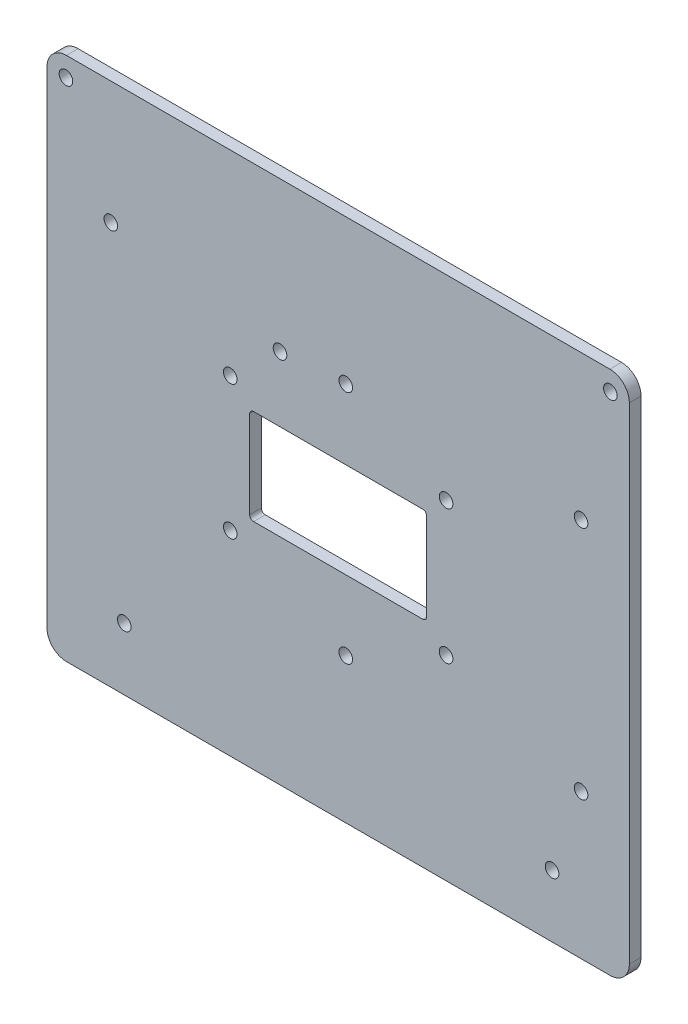
ISO-10303-21;
HEADER;
FILE_DESCRIPTION(('STEP AP214'),'2;1');
FILE_NAME('part.step','',(''),(''),'','','');
FILE_SCHEMA(('AUTOMOTIVE_DESIGN { 1 0 10303 214 1 1 1 1 }'));
ENDSEC;
DATA;
#1=APPLICATION_CONTEXT('core data for automotive mechanical design processes');
#2=APPLICATION_PROTOCOL_DEFINITION('international standard','automotive_design',2000,#1);
#3=PRODUCT_CONTEXT('',#1,'mechanical');
#4=PRODUCT('Part','Part','',(#3));
#5=PRODUCT_RELATED_PRODUCT_CATEGORY('part','',(#4));
#6=PRODUCT_DEFINITION_FORMATION('','',#4);
#7=PRODUCT_DEFINITION_CONTEXT('part definition',#1,'design');
#8=PRODUCT_DEFINITION('design','',#6,#7);
#9=PRODUCT_DEFINITION_SHAPE('','',#8);
#10=(LENGTH_UNIT() NAMED_UNIT(*) SI_UNIT(.MILLI.,.METRE.));
#11=(NAMED_UNIT(*) PLANE_ANGLE_UNIT() SI_UNIT($,.RADIAN.));
#12=(NAMED_UNIT(*) SI_UNIT($,.STERADIAN.) SOLID_ANGLE_UNIT());
#13=UNCERTAINTY_MEASURE_WITH_UNIT(LENGTH_MEASURE(1.E-05),#10,'distance_accuracy_value','');
#14=(GEOMETRIC_REPRESENTATION_CONTEXT(3) GLOBAL_UNCERTAINTY_ASSIGNED_CONTEXT((#13)) GLOBAL_UNIT_ASSIGNED_CONTEXT((#10,
#11,#12)) REPRESENTATION_CONTEXT('',''));
#15=CARTESIAN_POINT('',(0.,0.,0.));
#16=DIRECTION('',(0.,0.,1.));
#17=DIRECTION('',(1.,0.,0.));
#18=AXIS2_PLACEMENT_3D('',#15,#16,#17);
#19=CARTESIAN_POINT('',(0.,0.,3.));
#20=DIRECTION('',(0.,0.,1.));
#21=DIRECTION('',(1.,0.,0.));
#22=AXIS2_PLACEMENT_3D('',#19,#20,#21);
#23=PLANE('',#22);
#24=CARTESIAN_POINT('',(27.75,-17.25,3.));
#25=DIRECTION('',(0.,0.,1.));
#26=DIRECTION('',(1.,0.,0.));
#27=AXIS2_PLACEMENT_3D('',#24,#25,#26);
#28=CIRCLE('',#27,1.75);
#29=CARTESIAN_POINT('',(29.5,-17.25,3.));
#30=VERTEX_POINT('',#29);
#31=EDGE_CURVE('E841',#30,#30,#28,.T.);
#32=ORIENTED_EDGE('',*,*,#31,.F.);
#33=EDGE_LOOP('',(#32));
#34=FACE_BOUND('',#33,.T.);
#35=CARTESIAN_POINT('',(-27.75,17.25,3.));
#36=DIRECTION('',(0.,0.,1.));
#37=DIRECTION('',(1.,0.,0.));
#38=AXIS2_PLACEMENT_3D('',#35,#36,#37);
#39=CIRCLE('',#38,1.75);
#40=CARTESIAN_POINT('',(-26.,17.25,3.));
#41=VERTEX_POINT('',#40);
#42=EDGE_CURVE('E825',#41,#41,#39,.T.);
#43=ORIENTED_EDGE('',*,*,#42,.F.);
#44=EDGE_LOOP('',(#43));
#45=FACE_BOUND('',#44,.T.);
#46=CARTESIAN_POINT('',(62.4583333333333,-30.25,3.));
#47=DIRECTION('',(0.,0.,1.));
#48=DIRECTION('',(1.,0.,0.));
#49=AXIS2_PLACEMENT_3D('',#46,#47,#48);
#50=CIRCLE('',#49,1.74999999999996);
#51=CARTESIAN_POINT('',(64.2083333333333,-30.25,3.));
#52=VERTEX_POINT('',#51);
#53=EDGE_CURVE('E809',#52,#52,#50,.T.);
#54=ORIENTED_EDGE('',*,*,#53,.F.);
#55=EDGE_LOOP('',(#54));
#56=FACE_BOUND('',#55,.T.);
#57=CARTESIAN_POINT('',(1.95833333333333,30.25,3.));
#58=DIRECTION('',(0.,0.,1.));
#59=DIRECTION('',(1.,0.,0.));
#60=AXIS2_PLACEMENT_3D('',#57,#58,#59);
#61=CIRCLE('',#60,1.75);
#62=CARTESIAN_POINT('',(3.70833333333333,30.25,3.));
#63=VERTEX_POINT('',#62);
#64=EDGE_CURVE('E793',#63,#63,#61,.T.);
#65=ORIENTED_EDGE('',*,*,#64,.F.);
#66=EDGE_LOOP('',(#65));
#67=FACE_BOUND('',#66,.T.);
#68=CARTESIAN_POINT('',(-58.4583333333333,36.,3.));
#69=DIRECTION('',(0.,0.,1.));
#70=DIRECTION('',(1.,0.,0.));
#71=AXIS2_PLACEMENT_3D('',#68,#69,#70);
#72=CIRCLE('',#71,1.75);
#73=CARTESIAN_POINT('',(-56.7083333333333,36.,3.));
#74=VERTEX_POINT('',#73);
#75=EDGE_CURVE('E778',#74,#74,#72,.T.);
#76=ORIENTED_EDGE('',*,*,#75,.F.);
#77=EDGE_LOOP('',(#76));
#78=FACE_BOUND('',#77,.T.);
#79=CARTESIAN_POINT('',(70.,62.5,3.));
#80=DIRECTION('',(0.,0.,1.));
#81=DIRECTION('',(1.,0.,0.));
#82=AXIS2_PLACEMENT_3D('',#79,#80,#81);
#83=CIRCLE('',#82,1.75);
#84=CARTESIAN_POINT('',(71.75,62.5,3.));
#85=VERTEX_POINT('',#84);
#86=EDGE_CURVE('E327',#85,#85,#83,.T.);
#87=ORIENTED_EDGE('',*,*,#86,.F.);
#88=EDGE_LOOP('',(#87));
#89=FACE_BOUND('',#88,.T.);
#90=CARTESIAN_POINT('',(55.,-51.5,3.));
#91=DIRECTION('',(0.,0.,1.));
#92=DIRECTION('',(1.,0.,0.));
#93=AXIS2_PLACEMENT_3D('',#90,#91,#92);
#94=CIRCLE('',#93,1.75);
#95=CARTESIAN_POINT('',(56.75,-51.5,3.));
#96=VERTEX_POINT('',#95);
#97=EDGE_CURVE('E340',#96,#96,#94,.T.);
#98=ORIENTED_EDGE('',*,*,#97,.F.);
#99=EDGE_LOOP('',(#98));
#100=FACE_BOUND('',#99,.T.);
#101=DIRECTION('',(1.,0.,0.));
#102=VECTOR('',#101,1.);
#103=CARTESIAN_POINT('',(-74.875,-67.5,3.));
#104=LINE('',#103,#102);
#105=CARTESIAN_POINT('',(-69.875,-67.5,3.));
#106=VERTEX_POINT('',#105);
#107=CARTESIAN_POINT('',(69.875,-67.5,3.));
#108=VERTEX_POINT('',#107);
#109=EDGE_CURVE('E350',#106,#108,#104,.T.);
#110=ORIENTED_EDGE('',*,*,#109,.T.);
#111=CARTESIAN_POINT('',(69.875,-62.5,3.));
#112=DIRECTION('',(0.,0.,1.));
#113=DIRECTION('',(1.,0.,0.));
#114=AXIS2_PLACEMENT_3D('',#111,#112,#113);
#115=CIRCLE('',#114,5.);
#116=CARTESIAN_POINT('',(74.875,-62.5,3.));
#117=VERTEX_POINT('',#116);
#118=EDGE_CURVE('E223',#108,#117,#115,.T.);
#119=ORIENTED_EDGE('',*,*,#118,.T.);
#120=DIRECTION('',(0.,1.,0.));
#121=VECTOR('',#120,1.);
#122=CARTESIAN_POINT('',(74.875,67.5,3.));
#123=LINE('',#122,#121);
#124=CARTESIAN_POINT('',(74.875,62.5,3.));
#125=VERTEX_POINT('',#124);
#126=EDGE_CURVE('E178',#117,#125,#123,.T.);
#127=ORIENTED_EDGE('',*,*,#126,.T.);
#128=CARTESIAN_POINT('',(69.875,62.5,3.));
#129=DIRECTION('',(0.,0.,1.));
#130=DIRECTION('',(1.,0.,0.));
#131=AXIS2_PLACEMENT_3D('',#128,#129,#130);
#132=CIRCLE('',#131,5.);
#133=CARTESIAN_POINT('',(69.875,67.5,3.));
#134=VERTEX_POINT('',#133);
#135=EDGE_CURVE('E214',#125,#134,#132,.T.);
#136=ORIENTED_EDGE('',*,*,#135,.T.);
#137=DIRECTION('',(-1.,0.,0.));
#138=VECTOR('',#137,1.);
#139=CARTESIAN_POINT('',(-74.875,67.5,3.));
#140=LINE('',#139,#138);
#141=CARTESIAN_POINT('',(-69.875,67.5,3.));
#142=VERTEX_POINT('',#141);
#143=EDGE_CURVE('E200',#134,#142,#140,.T.);
#144=ORIENTED_EDGE('',*,*,#143,.T.);
#145=CARTESIAN_POINT('',(-69.875,62.5,3.));
#146=DIRECTION('',(0.,0.,1.));
#147=DIRECTION('',(1.,0.,0.));
#148=AXIS2_PLACEMENT_3D('',#145,#146,#147);
#149=CIRCLE('',#148,5.);
#150=CARTESIAN_POINT('',(-74.875,62.5,3.));
#151=VERTEX_POINT('',#150);
#152=EDGE_CURVE('E217',#142,#151,#149,.T.);
#153=ORIENTED_EDGE('',*,*,#152,.T.);
#154=DIRECTION('',(0.,-1.,0.));
#155=VECTOR('',#154,1.);
#156=CARTESIAN_POINT('',(-74.875,67.5,3.));
#157=LINE('',#156,#155);
#158=CARTESIAN_POINT('',(-74.875,-62.5,3.));
#159=VERTEX_POINT('',#158);
#160=EDGE_CURVE('E193',#151,#159,#157,.T.);
#161=ORIENTED_EDGE('',*,*,#160,.T.);
#162=CARTESIAN_POINT('',(-69.875,-62.5,3.));
#163=DIRECTION('',(0.,0.,1.));
#164=DIRECTION('',(1.,0.,0.));
#165=AXIS2_PLACEMENT_3D('',#162,#163,#164);
#166=CIRCLE('',#165,5.);
#167=EDGE_CURVE('E220',#159,#106,#166,.T.);
#168=ORIENTED_EDGE('',*,*,#167,.T.);
#169=EDGE_LOOP('',(#110,#119,#127,#136,#144,#153,#161,#168));
#170=FACE_BOUND('',#169,.T.);
#171=CARTESIAN_POINT('',(-55.,-51.5,3.));
#172=DIRECTION('',(0.,0.,1.));
#173=DIRECTION('',(-1.,0.,0.));
#174=AXIS2_PLACEMENT_3D('',#171,#172,#173);
#175=CIRCLE('',#174,1.75);
#176=CARTESIAN_POINT('',(-56.75,-51.5,3.));
#177=VERTEX_POINT('',#176);
#178=EDGE_CURVE('E332',#177,#177,#175,.T.);
#179=ORIENTED_EDGE('',*,*,#178,.F.);
#180=EDGE_LOOP('',(#179));
#181=FACE_BOUND('',#180,.T.);
#182=DIRECTION('',(1.,0.,0.));
#183=VECTOR('',#182,1.);
#184=CARTESIAN_POINT('',(-22.75,-12.25,3.));
#185=LINE('',#184,#183);
#186=CARTESIAN_POINT('',(-21.75,-12.25,3.));
#187=VERTEX_POINT('',#186);
#188=CARTESIAN_POINT('',(21.75,-12.25,3.));
#189=VERTEX_POINT('',#188);
#190=EDGE_CURVE('E306',#187,#189,#185,.T.);
#191=ORIENTED_EDGE('',*,*,#190,.F.);
#192=CARTESIAN_POINT('',(-21.75,-11.25,3.));
#193=DIRECTION('',(0.,0.,1.));
#194=DIRECTION('',(1.,0.,0.));
#195=AXIS2_PLACEMENT_3D('',#192,#193,#194);
#196=CIRCLE('',#195,1.);
#197=CARTESIAN_POINT('',(-22.75,-11.25,3.));
#198=VERTEX_POINT('',#197);
#199=EDGE_CURVE('E11',#187,#198,#196,.F.);
#200=ORIENTED_EDGE('',*,*,#199,.T.);
#201=DIRECTION('',(0.,-1.,0.));
#202=VECTOR('',#201,1.);
#203=CARTESIAN_POINT('',(-22.75,12.25,3.));
#204=LINE('',#203,#202);
#205=CARTESIAN_POINT('',(-22.75,11.25,3.));
#206=VERTEX_POINT('',#205);
#207=EDGE_CURVE('E303',#206,#198,#204,.T.);
#208=ORIENTED_EDGE('',*,*,#207,.F.);
#209=CARTESIAN_POINT('',(-21.75,11.25,3.));
#210=DIRECTION('',(0.,0.,1.));
#211=DIRECTION('',(1.,0.,0.));
#212=AXIS2_PLACEMENT_3D('',#209,#210,#211);
#213=CIRCLE('',#212,1.);
#214=CARTESIAN_POINT('',(-21.75,12.25,3.));
#215=VERTEX_POINT('',#214);
#216=EDGE_CURVE('E282',#206,#215,#213,.F.);
#217=ORIENTED_EDGE('',*,*,#216,.T.);
#218=DIRECTION('',(-1.,0.,0.));
#219=VECTOR('',#218,1.);
#220=CARTESIAN_POINT('',(-22.75,12.25,3.));
#221=LINE('',#220,#219);
#222=CARTESIAN_POINT('',(21.75,12.25,3.));
#223=VERTEX_POINT('',#222);
#224=EDGE_CURVE('E321',#223,#215,#221,.T.);
#225=ORIENTED_EDGE('',*,*,#224,.F.);
#226=CARTESIAN_POINT('',(21.75,11.25,3.));
#227=DIRECTION('',(0.,0.,1.));
#228=DIRECTION('',(1.,0.,0.));
#229=AXIS2_PLACEMENT_3D('',#226,#227,#228);
#230=CIRCLE('',#229,1.);
#231=CARTESIAN_POINT('',(22.75,11.25,3.));
#232=VERTEX_POINT('',#231);
#233=EDGE_CURVE('E270',#223,#232,#230,.F.);
#234=ORIENTED_EDGE('',*,*,#233,.T.);
#235=DIRECTION('',(0.,1.,0.));
#236=VECTOR('',#235,1.);
#237=CARTESIAN_POINT('',(22.75,12.25,3.));
#238=LINE('',#237,#236);
#239=CARTESIAN_POINT('',(22.75,-11.25,3.));
#240=VERTEX_POINT('',#239);
#241=EDGE_CURVE('E311',#240,#232,#238,.T.);
#242=ORIENTED_EDGE('',*,*,#241,.F.);
#243=CARTESIAN_POINT('',(21.75,-11.25,3.));
#244=DIRECTION('',(0.,0.,1.));
#245=DIRECTION('',(1.,0.,0.));
#246=AXIS2_PLACEMENT_3D('',#243,#244,#245);
#247=CIRCLE('',#246,1.);
#248=EDGE_CURVE('E276',#240,#189,#247,.F.);
#249=ORIENTED_EDGE('',*,*,#248,.T.);
#250=EDGE_LOOP('',(#191,#200,#208,#217,#225,#234,#242,#249));
#251=FACE_BOUND('',#250,.T.);
#252=CARTESIAN_POINT('',(-70.,62.5,3.));
#253=DIRECTION('',(0.,0.,1.));
#254=DIRECTION('',(1.,0.,0.));
#255=AXIS2_PLACEMENT_3D('',#252,#253,#254);
#256=CIRCLE('',#255,1.75);
#257=CARTESIAN_POINT('',(-68.25,62.5,3.));
#258=VERTEX_POINT('',#257);
#259=EDGE_CURVE('E769',#258,#258,#256,.T.);
#260=ORIENTED_EDGE('',*,*,#259,.F.);
#261=EDGE_LOOP('',(#260));
#262=FACE_BOUND('',#261,.T.);
#263=CARTESIAN_POINT('',(-14.9583333333333,29.,3.));
#264=DIRECTION('',(0.,0.,1.));
#265=DIRECTION('',(1.,0.,0.));
#266=AXIS2_PLACEMENT_3D('',#263,#264,#265);
#267=CIRCLE('',#266,1.75);
#268=CARTESIAN_POINT('',(-13.2083333333333,29.,3.));
#269=VERTEX_POINT('',#268);
#270=EDGE_CURVE('E785',#269,#269,#267,.T.);
#271=ORIENTED_EDGE('',*,*,#270,.F.);
#272=EDGE_LOOP('',(#271));
#273=FACE_BOUND('',#272,.T.);
#274=CARTESIAN_POINT('',(62.4583333333333,30.25,3.));
#275=DIRECTION('',(0.,0.,1.));
#276=DIRECTION('',(1.,0.,0.));
#277=AXIS2_PLACEMENT_3D('',#274,#275,#276);
#278=CIRCLE('',#277,1.75);
#279=CARTESIAN_POINT('',(64.2083333333333,30.25,3.));
#280=VERTEX_POINT('',#279);
#281=EDGE_CURVE('E801',#280,#280,#278,.T.);
#282=ORIENTED_EDGE('',*,*,#281,.F.);
#283=EDGE_LOOP('',(#282));
#284=FACE_BOUND('',#283,.T.);
#285=CARTESIAN_POINT('',(1.95833333333333,-30.25,3.));
#286=DIRECTION('',(0.,0.,1.));
#287=DIRECTION('',(1.,0.,0.));
#288=AXIS2_PLACEMENT_3D('',#285,#286,#287);
#289=CIRCLE('',#288,1.75);
#290=CARTESIAN_POINT('',(3.70833333333333,-30.25,3.));
#291=VERTEX_POINT('',#290);
#292=EDGE_CURVE('E817',#291,#291,#289,.T.);
#293=ORIENTED_EDGE('',*,*,#292,.F.);
#294=EDGE_LOOP('',(#293));
#295=FACE_BOUND('',#294,.T.);
#296=CARTESIAN_POINT('',(27.75,17.25,3.));
#297=DIRECTION('',(0.,0.,1.));
#298=DIRECTION('',(1.,0.,0.));
#299=AXIS2_PLACEMENT_3D('',#296,#297,#298);
#300=CIRCLE('',#299,1.75);
#301=CARTESIAN_POINT('',(29.5,17.25,3.));
#302=VERTEX_POINT('',#301);
#303=EDGE_CURVE('E833',#302,#302,#300,.T.);
#304=ORIENTED_EDGE('',*,*,#303,.F.);
#305=EDGE_LOOP('',(#304));
#306=FACE_BOUND('',#305,.T.);
#307=CARTESIAN_POINT('',(-27.75,-17.25,3.));
#308=DIRECTION('',(0.,0.,1.));
#309=DIRECTION('',(1.,0.,0.));
#310=AXIS2_PLACEMENT_3D('',#307,#308,#309);
#311=CIRCLE('',#310,1.75);
#312=CARTESIAN_POINT('',(-26.,-17.25,3.));
#313=VERTEX_POINT('',#312);
#314=EDGE_CURVE('E849',#313,#313,#311,.T.);
#315=ORIENTED_EDGE('',*,*,#314,.F.);
#316=EDGE_LOOP('',(#315));
#317=FACE_BOUND('',#316,.T.);
#318=ADVANCED_FACE('F43',(#34,#45,#56,#67,#78,#89,#100,#170,#181,#251,#262,#273,#284,#295,#306,
#317),#23,.T.);
#319=CARTESIAN_POINT('',(0.,0.,0.));
#320=DIRECTION('',(0.,0.,1.));
#321=DIRECTION('',(1.,0.,0.));
#322=AXIS2_PLACEMENT_3D('',#319,#320,#321);
#323=PLANE('',#322);
#324=CARTESIAN_POINT('',(-55.,-51.5,0.));
#325=DIRECTION('',(0.,0.,1.));
#326=DIRECTION('',(-1.,0.,0.));
#327=AXIS2_PLACEMENT_3D('',#324,#325,#326);
#328=CIRCLE('',#327,1.75);
#329=CARTESIAN_POINT('',(-56.75,-51.5,0.));
#330=VERTEX_POINT('',#329);
#331=EDGE_CURVE('E325',#330,#330,#328,.T.);
#332=ORIENTED_EDGE('',*,*,#331,.T.);
#333=EDGE_LOOP('',(#332));
#334=FACE_BOUND('',#333,.T.);
#335=CARTESIAN_POINT('',(55.,-51.5,0.));
#336=DIRECTION('',(0.,0.,1.));
#337=DIRECTION('',(1.,0.,0.));
#338=AXIS2_PLACEMENT_3D('',#335,#336,#337);
#339=CIRCLE('',#338,1.75);
#340=CARTESIAN_POINT('',(56.75,-51.5,0.));
#341=VERTEX_POINT('',#340);
#342=EDGE_CURVE('E336',#341,#341,#339,.T.);
#343=ORIENTED_EDGE('',*,*,#342,.T.);
#344=EDGE_LOOP('',(#343));
#345=FACE_BOUND('',#344,.T.);
#346=DIRECTION('',(0.,1.,0.));
#347=VECTOR('',#346,1.);
#348=CARTESIAN_POINT('',(74.875,67.5,0.));
#349=LINE('',#348,#347);
#350=CARTESIAN_POINT('',(74.875,-62.5,0.));
#351=VERTEX_POINT('',#350);
#352=CARTESIAN_POINT('',(74.875,62.5,0.));
#353=VERTEX_POINT('',#352);
#354=EDGE_CURVE('E175',#351,#353,#349,.T.);
#355=ORIENTED_EDGE('',*,*,#354,.F.);
#356=CARTESIAN_POINT('',(69.875,-62.5,0.));
#357=DIRECTION('',(0.,0.,1.));
#358=DIRECTION('',(1.,0.,0.));
#359=AXIS2_PLACEMENT_3D('',#356,#357,#358);
#360=CIRCLE('',#359,5.);
#361=CARTESIAN_POINT('',(69.875,-67.5,0.));
#362=VERTEX_POINT('',#361);
#363=EDGE_CURVE('E157',#351,#362,#360,.F.);
#364=ORIENTED_EDGE('',*,*,#363,.T.);
#365=DIRECTION('',(1.,0.,0.));
#366=VECTOR('',#365,1.);
#367=CARTESIAN_POINT('',(-74.875,-67.5,0.));
#368=LINE('',#367,#366);
#369=CARTESIAN_POINT('',(-69.875,-67.5,0.));
#370=VERTEX_POINT('',#369);
#371=EDGE_CURVE('E188',#370,#362,#368,.T.);
#372=ORIENTED_EDGE('',*,*,#371,.F.);
#373=CARTESIAN_POINT('',(-69.875,-62.5,0.));
#374=DIRECTION('',(0.,0.,1.));
#375=DIRECTION('',(1.,0.,0.));
#376=AXIS2_PLACEMENT_3D('',#373,#374,#375);
#377=CIRCLE('',#376,5.);
#378=CARTESIAN_POINT('',(-74.875,-62.5,0.));
#379=VERTEX_POINT('',#378);
#380=EDGE_CURVE('E169',#370,#379,#377,.F.);
#381=ORIENTED_EDGE('',*,*,#380,.T.);
#382=DIRECTION('',(0.,-1.,0.));
#383=VECTOR('',#382,1.);
#384=CARTESIAN_POINT('',(-74.875,67.5,0.));
#385=LINE('',#384,#383);
#386=CARTESIAN_POINT('',(-74.875,62.5,0.));
#387=VERTEX_POINT('',#386);
#388=EDGE_CURVE('E195',#387,#379,#385,.T.);
#389=ORIENTED_EDGE('',*,*,#388,.F.);
#390=CARTESIAN_POINT('',(-69.875,62.5,0.));
#391=DIRECTION('',(0.,0.,1.));
#392=DIRECTION('',(1.,0.,0.));
#393=AXIS2_PLACEMENT_3D('',#390,#391,#392);
#394=CIRCLE('',#393,5.);
#395=CARTESIAN_POINT('',(-69.875,67.5,0.));
#396=VERTEX_POINT('',#395);
#397=EDGE_CURVE('E204',#387,#396,#394,.F.);
#398=ORIENTED_EDGE('',*,*,#397,.T.);
#399=DIRECTION('',(-1.,0.,0.));
#400=VECTOR('',#399,1.);
#401=CARTESIAN_POINT('',(-74.875,67.5,0.));
#402=LINE('',#401,#400);
#403=CARTESIAN_POINT('',(69.875,67.5,0.));
#404=VERTEX_POINT('',#403);
#405=EDGE_CURVE('E187',#404,#396,#402,.T.);
#406=ORIENTED_EDGE('',*,*,#405,.F.);
#407=CARTESIAN_POINT('',(69.875,62.5,0.));
#408=DIRECTION('',(0.,0.,1.));
#409=DIRECTION('',(1.,0.,0.));
#410=AXIS2_PLACEMENT_3D('',#407,#408,#409);
#411=CIRCLE('',#410,5.);
#412=EDGE_CURVE('E180',#404,#353,#411,.F.);
#413=ORIENTED_EDGE('',*,*,#412,.T.);
#414=EDGE_LOOP('',(#355,#364,#372,#381,#389,#398,#406,#413));
#415=FACE_BOUND('',#414,.T.);
#416=DIRECTION('',(-1.,0.,0.));
#417=VECTOR('',#416,1.);
#418=CARTESIAN_POINT('',(-22.75,12.25,0.));
#419=LINE('',#418,#417);
#420=CARTESIAN_POINT('',(21.75,12.25,0.));
#421=VERTEX_POINT('',#420);
#422=CARTESIAN_POINT('',(-21.75,12.25,0.));
#423=VERTEX_POINT('',#422);
#424=EDGE_CURVE('E307',#421,#423,#419,.T.);
#425=ORIENTED_EDGE('',*,*,#424,.T.);
#426=CARTESIAN_POINT('',(-21.75,11.25,0.));
#427=DIRECTION('',(0.,0.,1.));
#428=DIRECTION('',(1.,0.,0.));
#429=AXIS2_PLACEMENT_3D('',#426,#427,#428);
#430=CIRCLE('',#429,1.);
#431=CARTESIAN_POINT('',(-22.75,11.25,0.));
#432=VERTEX_POINT('',#431);
#433=EDGE_CURVE('E279',#423,#432,#430,.T.);
#434=ORIENTED_EDGE('',*,*,#433,.T.);
#435=DIRECTION('',(0.,-1.,0.));
#436=VECTOR('',#435,1.);
#437=CARTESIAN_POINT('',(-22.75,12.25,0.));
#438=LINE('',#437,#436);
#439=CARTESIAN_POINT('',(-22.75,-11.25,0.));
#440=VERTEX_POINT('',#439);
#441=EDGE_CURVE('E291',#432,#440,#438,.T.);
#442=ORIENTED_EDGE('',*,*,#441,.T.);
#443=CARTESIAN_POINT('',(-21.75,-11.25,0.));
#444=DIRECTION('',(0.,0.,1.));
#445=DIRECTION('',(1.,0.,0.));
#446=AXIS2_PLACEMENT_3D('',#443,#444,#445);
#447=CIRCLE('',#446,1.);
#448=CARTESIAN_POINT('',(-21.75,-12.25,0.));
#449=VERTEX_POINT('',#448);
#450=EDGE_CURVE('E52',#440,#449,#447,.T.);
#451=ORIENTED_EDGE('',*,*,#450,.T.);
#452=DIRECTION('',(1.,0.,0.));
#453=VECTOR('',#452,1.);
#454=CARTESIAN_POINT('',(-22.75,-12.25,0.));
#455=LINE('',#454,#453);
#456=CARTESIAN_POINT('',(21.75,-12.25,0.));
#457=VERTEX_POINT('',#456);
#458=EDGE_CURVE('E290',#449,#457,#455,.T.);
#459=ORIENTED_EDGE('',*,*,#458,.T.);
#460=CARTESIAN_POINT('',(21.75,-11.25,0.));
#461=DIRECTION('',(0.,0.,1.));
#462=DIRECTION('',(1.,0.,0.));
#463=AXIS2_PLACEMENT_3D('',#460,#461,#462);
#464=CIRCLE('',#463,1.);
#465=CARTESIAN_POINT('',(22.75,-11.25,0.));
#466=VERTEX_POINT('',#465);
#467=EDGE_CURVE('E273',#457,#466,#464,.T.);
#468=ORIENTED_EDGE('',*,*,#467,.T.);
#469=DIRECTION('',(0.,1.,0.));
#470=VECTOR('',#469,1.);
#471=CARTESIAN_POINT('',(22.75,12.25,0.));
#472=LINE('',#471,#470);
#473=CARTESIAN_POINT('',(22.75,11.25,0.));
#474=VERTEX_POINT('',#473);
#475=EDGE_CURVE('E300',#466,#474,#472,.T.);
#476=ORIENTED_EDGE('',*,*,#475,.T.);
#477=CARTESIAN_POINT('',(21.75,11.25,0.));
#478=DIRECTION('',(0.,0.,1.));
#479=DIRECTION('',(1.,0.,0.));
#480=AXIS2_PLACEMENT_3D('',#477,#478,#479);
#481=CIRCLE('',#480,1.);
#482=EDGE_CURVE('E267',#474,#421,#481,.T.);
#483=ORIENTED_EDGE('',*,*,#482,.T.);
#484=EDGE_LOOP('',(#425,#434,#442,#451,#459,#468,#476,#483));
#485=FACE_BOUND('',#484,.T.);
#486=CARTESIAN_POINT('',(70.,62.5,0.));
#487=DIRECTION('',(0.,0.,1.));
#488=DIRECTION('',(1.,0.,0.));
#489=AXIS2_PLACEMENT_3D('',#486,#487,#488);
#490=CIRCLE('',#489,1.75);
#491=CARTESIAN_POINT('',(71.75,62.5,0.));
#492=VERTEX_POINT('',#491);
#493=EDGE_CURVE('E315',#492,#492,#490,.T.);
#494=ORIENTED_EDGE('',*,*,#493,.T.);
#495=EDGE_LOOP('',(#494));
#496=FACE_BOUND('',#495,.T.);
#497=CARTESIAN_POINT('',(-70.,62.5,0.));
#498=DIRECTION('',(0.,0.,1.));
#499=DIRECTION('',(1.,0.,0.));
#500=AXIS2_PLACEMENT_3D('',#497,#498,#499);
#501=CIRCLE('',#500,1.75);
#502=CARTESIAN_POINT('',(-68.25,62.5,0.));
#503=VERTEX_POINT('',#502);
#504=EDGE_CURVE('E773',#503,#503,#501,.T.);
#505=ORIENTED_EDGE('',*,*,#504,.T.);
#506=EDGE_LOOP('',(#505));
#507=FACE_BOUND('',#506,.T.);
#508=CARTESIAN_POINT('',(-58.4583333333333,36.,0.));
#509=DIRECTION('',(0.,0.,1.));
#510=DIRECTION('',(1.,0.,0.));
#511=AXIS2_PLACEMENT_3D('',#508,#509,#510);
#512=CIRCLE('',#511,1.75);
#513=CARTESIAN_POINT('',(-56.7083333333333,36.,0.));
#514=VERTEX_POINT('',#513);
#515=EDGE_CURVE('E781',#514,#514,#512,.T.);
#516=ORIENTED_EDGE('',*,*,#515,.T.);
#517=EDGE_LOOP('',(#516));
#518=FACE_BOUND('',#517,.T.);
#519=CARTESIAN_POINT('',(-14.9583333333333,29.,0.));
#520=DIRECTION('',(0.,0.,1.));
#521=DIRECTION('',(1.,0.,0.));
#522=AXIS2_PLACEMENT_3D('',#519,#520,#521);
#523=CIRCLE('',#522,1.75);
#524=CARTESIAN_POINT('',(-13.2083333333333,29.,0.));
#525=VERTEX_POINT('',#524);
#526=EDGE_CURVE('E789',#525,#525,#523,.T.);
#527=ORIENTED_EDGE('',*,*,#526,.T.);
#528=EDGE_LOOP('',(#527));
#529=FACE_BOUND('',#528,.T.);
#530=CARTESIAN_POINT('',(1.95833333333333,30.25,0.));
#531=DIRECTION('',(0.,0.,1.));
#532=DIRECTION('',(1.,0.,0.));
#533=AXIS2_PLACEMENT_3D('',#530,#531,#532);
#534=CIRCLE('',#533,1.75);
#535=CARTESIAN_POINT('',(3.70833333333333,30.25,0.));
#536=VERTEX_POINT('',#535);
#537=EDGE_CURVE('E797',#536,#536,#534,.T.);
#538=ORIENTED_EDGE('',*,*,#537,.T.);
#539=EDGE_LOOP('',(#538));
#540=FACE_BOUND('',#539,.T.);
#541=CARTESIAN_POINT('',(62.4583333333333,30.25,0.));
#542=DIRECTION('',(0.,0.,1.));
#543=DIRECTION('',(1.,0.,0.));
#544=AXIS2_PLACEMENT_3D('',#541,#542,#543);
#545=CIRCLE('',#544,1.75);
#546=CARTESIAN_POINT('',(64.2083333333333,30.25,0.));
#547=VERTEX_POINT('',#546);
#548=EDGE_CURVE('E805',#547,#547,#545,.T.);
#549=ORIENTED_EDGE('',*,*,#548,.T.);
#550=EDGE_LOOP('',(#549));
#551=FACE_BOUND('',#550,.T.);
#552=CARTESIAN_POINT('',(62.4583333333333,-30.25,0.));
#553=DIRECTION('',(0.,0.,1.));
#554=DIRECTION('',(1.,0.,0.));
#555=AXIS2_PLACEMENT_3D('',#552,#553,#554);
#556=CIRCLE('',#555,1.74999999999996);
#557=CARTESIAN_POINT('',(64.2083333333333,-30.25,0.));
#558=VERTEX_POINT('',#557);
#559=EDGE_CURVE('E813',#558,#558,#556,.T.);
#560=ORIENTED_EDGE('',*,*,#559,.T.);
#561=EDGE_LOOP('',(#560));
#562=FACE_BOUND('',#561,.T.);
#563=CARTESIAN_POINT('',(1.95833333333333,-30.25,0.));
#564=DIRECTION('',(0.,0.,1.));
#565=DIRECTION('',(1.,0.,0.));
#566=AXIS2_PLACEMENT_3D('',#563,#564,#565);
#567=CIRCLE('',#566,1.75);
#568=CARTESIAN_POINT('',(3.70833333333333,-30.25,0.));
#569=VERTEX_POINT('',#568);
#570=EDGE_CURVE('E821',#569,#569,#567,.T.);
#571=ORIENTED_EDGE('',*,*,#570,.T.);
#572=EDGE_LOOP('',(#571));
#573=FACE_BOUND('',#572,.T.);
#574=CARTESIAN_POINT('',(-27.75,17.25,0.));
#575=DIRECTION('',(0.,0.,1.));
#576=DIRECTION('',(1.,0.,0.));
#577=AXIS2_PLACEMENT_3D('',#574,#575,#576);
#578=CIRCLE('',#577,1.75);
#579=CARTESIAN_POINT('',(-26.,17.25,0.));
#580=VERTEX_POINT('',#579);
#581=EDGE_CURVE('E829',#580,#580,#578,.T.);
#582=ORIENTED_EDGE('',*,*,#581,.T.);
#583=EDGE_LOOP('',(#582));
#584=FACE_BOUND('',#583,.T.);
#585=CARTESIAN_POINT('',(27.75,17.25,0.));
#586=DIRECTION('',(0.,0.,1.));
#587=DIRECTION('',(1.,0.,0.));
#588=AXIS2_PLACEMENT_3D('',#585,#586,#587);
#589=CIRCLE('',#588,1.75);
#590=CARTESIAN_POINT('',(29.5,17.25,0.));
#591=VERTEX_POINT('',#590);
#592=EDGE_CURVE('E837',#591,#591,#589,.T.);
#593=ORIENTED_EDGE('',*,*,#592,.T.);
#594=EDGE_LOOP('',(#593));
#595=FACE_BOUND('',#594,.T.);
#596=CARTESIAN_POINT('',(27.75,-17.25,0.));
#597=DIRECTION('',(0.,0.,1.));
#598=DIRECTION('',(1.,0.,0.));
#599=AXIS2_PLACEMENT_3D('',#596,#597,#598);
#600=CIRCLE('',#599,1.75);
#601=CARTESIAN_POINT('',(29.5,-17.25,0.));
#602=VERTEX_POINT('',#601);
#603=EDGE_CURVE('E845',#602,#602,#600,.T.);
#604=ORIENTED_EDGE('',*,*,#603,.T.);
#605=EDGE_LOOP('',(#604));
#606=FACE_BOUND('',#605,.T.);
#607=CARTESIAN_POINT('',(-27.75,-17.25,0.));
#608=DIRECTION('',(0.,0.,1.));
#609=DIRECTION('',(1.,0.,0.));
#610=AXIS2_PLACEMENT_3D('',#607,#608,#609);
#611=CIRCLE('',#610,1.75);
#612=CARTESIAN_POINT('',(-26.,-17.25,0.));
#613=VERTEX_POINT('',#612);
#614=EDGE_CURVE('E853',#613,#613,#611,.T.);
#615=ORIENTED_EDGE('',*,*,#614,.T.);
#616=EDGE_LOOP('',(#615));
#617=FACE_BOUND('',#616,.T.);
#618=ADVANCED_FACE('F183',(#334,#345,#415,#485,#496,#507,#518,#529,#540,#551,#562,#573,#584,
#595,#606,#617),#323,.F.);
#619=CARTESIAN_POINT('',(-74.875,67.5,3.));
#620=DIRECTION('',(1.,0.,0.));
#621=DIRECTION('',(0.,0.,-1.));
#622=AXIS2_PLACEMENT_3D('',#619,#620,#621);
#623=PLANE('',#622);
#624=ORIENTED_EDGE('',*,*,#388,.T.);
#625=DIRECTION('',(0.,0.,-1.));
#626=VECTOR('',#625,1.);
#627=CARTESIAN_POINT('',(-74.875,-62.5,3.));
#628=LINE('',#627,#626);
#629=EDGE_CURVE('E230',#379,#159,#628,.F.);
#630=ORIENTED_EDGE('',*,*,#629,.T.);
#631=ORIENTED_EDGE('',*,*,#160,.F.);
#632=DIRECTION('',(0.,0.,-1.));
#633=VECTOR('',#632,1.);
#634=CARTESIAN_POINT('',(-74.875,62.5,3.));
#635=LINE('',#634,#633);
#636=EDGE_CURVE('E226',#151,#387,#635,.T.);
#637=ORIENTED_EDGE('',*,*,#636,.T.);
#638=EDGE_LOOP('',(#624,#630,#631,#637));
#639=FACE_BOUND('',#638,.T.);
#640=ADVANCED_FACE('F363',(#639),#623,.F.);
#641=CARTESIAN_POINT('',(-74.875,-67.5,3.));
#642=DIRECTION('',(0.,1.,0.));
#643=DIRECTION('',(0.,0.,1.));
#644=AXIS2_PLACEMENT_3D('',#641,#642,#643);
#645=PLANE('',#644);
#646=ORIENTED_EDGE('',*,*,#371,.T.);
#647=DIRECTION('',(0.,0.,-1.));
#648=VECTOR('',#647,1.);
#649=CARTESIAN_POINT('',(69.875,-67.5,3.));
#650=LINE('',#649,#648);
#651=EDGE_CURVE('E162',#362,#108,#650,.F.);
#652=ORIENTED_EDGE('',*,*,#651,.T.);
#653=ORIENTED_EDGE('',*,*,#109,.F.);
#654=DIRECTION('',(0.,0.,-1.));
#655=VECTOR('',#654,1.);
#656=CARTESIAN_POINT('',(-69.875,-67.5,3.));
#657=LINE('',#656,#655);
#658=EDGE_CURVE('E168',#106,#370,#657,.T.);
#659=ORIENTED_EDGE('',*,*,#658,.T.);
#660=EDGE_LOOP('',(#646,#652,#653,#659));
#661=FACE_BOUND('',#660,.T.);
#662=ADVANCED_FACE('F374',(#661),#645,.F.);
#663=CARTESIAN_POINT('',(74.875,67.5,3.));
#664=DIRECTION('',(-1.,0.,0.));
#665=DIRECTION('',(0.,0.,1.));
#666=AXIS2_PLACEMENT_3D('',#663,#664,#665);
#667=PLANE('',#666);
#668=ORIENTED_EDGE('',*,*,#126,.F.);
#669=DIRECTION('',(0.,0.,-1.));
#670=VECTOR('',#669,1.);
#671=CARTESIAN_POINT('',(74.875,-62.5,3.));
#672=LINE('',#671,#670);
#673=EDGE_CURVE('E161',#117,#351,#672,.T.);
#674=ORIENTED_EDGE('',*,*,#673,.T.);
#675=ORIENTED_EDGE('',*,*,#354,.T.);
#676=DIRECTION('',(0.,0.,-1.));
#677=VECTOR('',#676,1.);
#678=CARTESIAN_POINT('',(74.875,62.5,3.));
#679=LINE('',#678,#677);
#680=EDGE_CURVE('E181',#353,#125,#679,.F.);
#681=ORIENTED_EDGE('',*,*,#680,.T.);
#682=EDGE_LOOP('',(#668,#674,#675,#681));
#683=FACE_BOUND('',#682,.T.);
#684=ADVANCED_FACE('F174',(#683),#667,.F.);
#685=CARTESIAN_POINT('',(-74.875,67.5,3.));
#686=DIRECTION('',(0.,-1.,0.));
#687=DIRECTION('',(0.,0.,-1.));
#688=AXIS2_PLACEMENT_3D('',#685,#686,#687);
#689=PLANE('',#688);
#690=ORIENTED_EDGE('',*,*,#405,.T.);
#691=DIRECTION('',(0.,0.,-1.));
#692=VECTOR('',#691,1.);
#693=CARTESIAN_POINT('',(-69.875,67.5,3.));
#694=LINE('',#693,#692);
#695=EDGE_CURVE('E237',#396,#142,#694,.F.);
#696=ORIENTED_EDGE('',*,*,#695,.T.);
#697=ORIENTED_EDGE('',*,*,#143,.F.);
#698=DIRECTION('',(0.,0.,-1.));
#699=VECTOR('',#698,1.);
#700=CARTESIAN_POINT('',(69.875,67.5,3.));
#701=LINE('',#700,#699);
#702=EDGE_CURVE('E233',#134,#404,#701,.T.);
#703=ORIENTED_EDGE('',*,*,#702,.T.);
#704=EDGE_LOOP('',(#690,#696,#697,#703));
#705=FACE_BOUND('',#704,.T.);
#706=ADVANCED_FACE('F381',(#705),#689,.F.);
#707=CARTESIAN_POINT('',(55.,-51.5,3.));
#708=DIRECTION('',(0.,0.,-1.));
#709=DIRECTION('',(-1.,0.,0.));
#710=AXIS2_PLACEMENT_3D('',#707,#708,#709);
#711=CYLINDRICAL_SURFACE('',#710,1.75);
#712=ORIENTED_EDGE('',*,*,#97,.T.);
#713=EDGE_LOOP('',(#712));
#714=FACE_BOUND('',#713,.T.);
#715=ORIENTED_EDGE('',*,*,#342,.F.);
#716=EDGE_LOOP('',(#715));
#717=FACE_BOUND('',#716,.T.);
#718=ADVANCED_FACE('F395',(#714,#717),#711,.F.);
#719=CARTESIAN_POINT('',(-55.,-51.5,3.));
#720=DIRECTION('',(0.,0.,-1.));
#721=DIRECTION('',(-1.,0.,0.));
#722=AXIS2_PLACEMENT_3D('',#719,#720,#721);
#723=CYLINDRICAL_SURFACE('',#722,1.75);
#724=ORIENTED_EDGE('',*,*,#178,.T.);
#725=EDGE_LOOP('',(#724));
#726=FACE_BOUND('',#725,.T.);
#727=ORIENTED_EDGE('',*,*,#331,.F.);
#728=EDGE_LOOP('',(#727));
#729=FACE_BOUND('',#728,.T.);
#730=ADVANCED_FACE('F403',(#726,#729),#723,.F.);
#731=CARTESIAN_POINT('',(-22.75,12.25,3.));
#732=DIRECTION('',(1.,0.,0.));
#733=DIRECTION('',(0.,0.,-1.));
#734=AXIS2_PLACEMENT_3D('',#731,#732,#733);
#735=PLANE('',#734);
#736=ORIENTED_EDGE('',*,*,#441,.F.);
#737=DIRECTION('',(0.,0.,-1.));
#738=VECTOR('',#737,1.);
#739=CARTESIAN_POINT('',(-22.75,11.25,3.));
#740=LINE('',#739,#738);
#741=EDGE_CURVE('E64',#432,#206,#740,.F.);
#742=ORIENTED_EDGE('',*,*,#741,.T.);
#743=ORIENTED_EDGE('',*,*,#207,.T.);
#744=DIRECTION('',(0.,0.,-1.));
#745=VECTOR('',#744,1.);
#746=CARTESIAN_POINT('',(-22.75,-11.25,0.));
#747=LINE('',#746,#745);
#748=EDGE_CURVE('E261',#198,#440,#747,.T.);
#749=ORIENTED_EDGE('',*,*,#748,.T.);
#750=EDGE_LOOP('',(#736,#742,#743,#749));
#751=FACE_BOUND('',#750,.T.);
#752=ADVANCED_FACE('F302',(#751),#735,.T.);
#753=CARTESIAN_POINT('',(-22.75,-12.25,3.));
#754=DIRECTION('',(0.,1.,0.));
#755=DIRECTION('',(-1.,0.,0.));
#756=AXIS2_PLACEMENT_3D('',#753,#754,#755);
#757=PLANE('',#756);
#758=ORIENTED_EDGE('',*,*,#190,.T.);
#759=DIRECTION('',(0.,0.,-1.));
#760=VECTOR('',#759,1.);
#761=CARTESIAN_POINT('',(21.75,-12.25,0.));
#762=LINE('',#761,#760);
#763=EDGE_CURVE('E257',#189,#457,#762,.T.);
#764=ORIENTED_EDGE('',*,*,#763,.T.);
#765=ORIENTED_EDGE('',*,*,#458,.F.);
#766=DIRECTION('',(0.,0.,-1.));
#767=VECTOR('',#766,1.);
#768=CARTESIAN_POINT('',(-21.75,-12.25,3.));
#769=LINE('',#768,#767);
#770=EDGE_CURVE('E254',#449,#187,#769,.F.);
#771=ORIENTED_EDGE('',*,*,#770,.T.);
#772=EDGE_LOOP('',(#758,#764,#765,#771));
#773=FACE_BOUND('',#772,.T.);
#774=ADVANCED_FACE('F297',(#773),#757,.T.);
#775=CARTESIAN_POINT('',(22.75,12.25,3.));
#776=DIRECTION('',(-1.,0.,0.));
#777=DIRECTION('',(0.,0.,1.));
#778=AXIS2_PLACEMENT_3D('',#775,#776,#777);
#779=PLANE('',#778);
#780=ORIENTED_EDGE('',*,*,#241,.T.);
#781=DIRECTION('',(0.,0.,-1.));
#782=VECTOR('',#781,1.);
#783=CARTESIAN_POINT('',(22.75,11.25,0.));
#784=LINE('',#783,#782);
#785=EDGE_CURVE('E243',#232,#474,#784,.T.);
#786=ORIENTED_EDGE('',*,*,#785,.T.);
#787=ORIENTED_EDGE('',*,*,#475,.F.);
#788=DIRECTION('',(0.,0.,-1.));
#789=VECTOR('',#788,1.);
#790=CARTESIAN_POINT('',(22.75,-11.25,3.));
#791=LINE('',#790,#789);
#792=EDGE_CURVE('E240',#466,#240,#791,.F.);
#793=ORIENTED_EDGE('',*,*,#792,.T.);
#794=EDGE_LOOP('',(#780,#786,#787,#793));
#795=FACE_BOUND('',#794,.T.);
#796=ADVANCED_FACE('F447',(#795),#779,.T.);
#797=CARTESIAN_POINT('',(-22.75,12.25,3.));
#798=DIRECTION('',(0.,-1.,0.));
#799=DIRECTION('',(1.,0.,0.));
#800=AXIS2_PLACEMENT_3D('',#797,#798,#799);
#801=PLANE('',#800);
#802=ORIENTED_EDGE('',*,*,#424,.F.);
#803=DIRECTION('',(0.,0.,-1.));
#804=VECTOR('',#803,1.);
#805=CARTESIAN_POINT('',(21.75,12.25,3.));
#806=LINE('',#805,#804);
#807=EDGE_CURVE('E251',#421,#223,#806,.F.);
#808=ORIENTED_EDGE('',*,*,#807,.T.);
#809=ORIENTED_EDGE('',*,*,#224,.T.);
#810=DIRECTION('',(0.,0.,-1.));
#811=VECTOR('',#810,1.);
#812=CARTESIAN_POINT('',(-21.75,12.25,0.));
#813=LINE('',#812,#811);
#814=EDGE_CURVE('E247',#215,#423,#813,.T.);
#815=ORIENTED_EDGE('',*,*,#814,.T.);
#816=EDGE_LOOP('',(#802,#808,#809,#815));
#817=FACE_BOUND('',#816,.T.);
#818=ADVANCED_FACE('F441',(#817),#801,.T.);
#819=CARTESIAN_POINT('',(70.,62.5,3.));
#820=DIRECTION('',(0.,0.,-1.));
#821=DIRECTION('',(-1.,0.,0.));
#822=AXIS2_PLACEMENT_3D('',#819,#820,#821);
#823=CYLINDRICAL_SURFACE('',#822,1.75);
#824=ORIENTED_EDGE('',*,*,#86,.T.);
#825=EDGE_LOOP('',(#824));
#826=FACE_BOUND('',#825,.T.);
#827=ORIENTED_EDGE('',*,*,#493,.F.);
#828=EDGE_LOOP('',(#827));
#829=FACE_BOUND('',#828,.T.);
#830=ADVANCED_FACE('F456',(#826,#829),#823,.F.);
#831=CARTESIAN_POINT('',(-70.,62.5,3.));
#832=DIRECTION('',(0.,0.,-1.));
#833=DIRECTION('',(-1.,0.,0.));
#834=AXIS2_PLACEMENT_3D('',#831,#832,#833);
#835=CYLINDRICAL_SURFACE('',#834,1.75);
#836=ORIENTED_EDGE('',*,*,#259,.T.);
#837=EDGE_LOOP('',(#836));
#838=FACE_BOUND('',#837,.T.);
#839=ORIENTED_EDGE('',*,*,#504,.F.);
#840=EDGE_LOOP('',(#839));
#841=FACE_BOUND('',#840,.T.);
#842=ADVANCED_FACE('F655',(#838,#841),#835,.F.);
#843=CARTESIAN_POINT('',(-58.4583333333333,36.,3.));
#844=DIRECTION('',(0.,0.,-1.));
#845=DIRECTION('',(-1.,0.,0.));
#846=AXIS2_PLACEMENT_3D('',#843,#844,#845);
#847=CYLINDRICAL_SURFACE('',#846,1.75);
#848=ORIENTED_EDGE('',*,*,#75,.T.);
#849=EDGE_LOOP('',(#848));
#850=FACE_BOUND('',#849,.T.);
#851=ORIENTED_EDGE('',*,*,#515,.F.);
#852=EDGE_LOOP('',(#851));
#853=FACE_BOUND('',#852,.T.);
#854=ADVANCED_FACE('F645',(#850,#853),#847,.F.);
#855=CARTESIAN_POINT('',(-14.9583333333333,29.,3.));
#856=DIRECTION('',(0.,0.,-1.));
#857=DIRECTION('',(-1.,0.,0.));
#858=AXIS2_PLACEMENT_3D('',#855,#856,#857);
#859=CYLINDRICAL_SURFACE('',#858,1.75);
#860=ORIENTED_EDGE('',*,*,#270,.T.);
#861=EDGE_LOOP('',(#860));
#862=FACE_BOUND('',#861,.T.);
#863=ORIENTED_EDGE('',*,*,#526,.F.);
#864=EDGE_LOOP('',(#863));
#865=FACE_BOUND('',#864,.T.);
#866=ADVANCED_FACE('F635',(#862,#865),#859,.F.);
#867=CARTESIAN_POINT('',(1.95833333333333,30.25,3.));
#868=DIRECTION('',(0.,0.,-1.));
#869=DIRECTION('',(-1.,0.,0.));
#870=AXIS2_PLACEMENT_3D('',#867,#868,#869);
#871=CYLINDRICAL_SURFACE('',#870,1.75);
#872=ORIENTED_EDGE('',*,*,#64,.T.);
#873=EDGE_LOOP('',(#872));
#874=FACE_BOUND('',#873,.T.);
#875=ORIENTED_EDGE('',*,*,#537,.F.);
#876=EDGE_LOOP('',(#875));
#877=FACE_BOUND('',#876,.T.);
#878=ADVANCED_FACE('F625',(#874,#877),#871,.F.);
#879=CARTESIAN_POINT('',(62.4583333333333,30.25,3.));
#880=DIRECTION('',(0.,0.,-1.));
#881=DIRECTION('',(-1.,0.,0.));
#882=AXIS2_PLACEMENT_3D('',#879,#880,#881);
#883=CYLINDRICAL_SURFACE('',#882,1.75);
#884=ORIENTED_EDGE('',*,*,#281,.T.);
#885=EDGE_LOOP('',(#884));
#886=FACE_BOUND('',#885,.T.);
#887=ORIENTED_EDGE('',*,*,#548,.F.);
#888=EDGE_LOOP('',(#887));
#889=FACE_BOUND('',#888,.T.);
#890=ADVANCED_FACE('F615',(#886,#889),#883,.F.);
#891=CARTESIAN_POINT('',(62.4583333333333,-30.25,3.));
#892=DIRECTION('',(0.,0.,-1.));
#893=DIRECTION('',(-1.,0.,0.));
#894=AXIS2_PLACEMENT_3D('',#891,#892,#893);
#895=CYLINDRICAL_SURFACE('',#894,1.74999999999996);
#896=ORIENTED_EDGE('',*,*,#53,.T.);
#897=EDGE_LOOP('',(#896));
#898=FACE_BOUND('',#897,.T.);
#899=ORIENTED_EDGE('',*,*,#559,.F.);
#900=EDGE_LOOP('',(#899));
#901=FACE_BOUND('',#900,.T.);
#902=ADVANCED_FACE('F605',(#898,#901),#895,.F.);
#903=CARTESIAN_POINT('',(1.95833333333333,-30.25,3.));
#904=DIRECTION('',(0.,0.,-1.));
#905=DIRECTION('',(-1.,0.,0.));
#906=AXIS2_PLACEMENT_3D('',#903,#904,#905);
#907=CYLINDRICAL_SURFACE('',#906,1.75);
#908=ORIENTED_EDGE('',*,*,#292,.T.);
#909=EDGE_LOOP('',(#908));
#910=FACE_BOUND('',#909,.T.);
#911=ORIENTED_EDGE('',*,*,#570,.F.);
#912=EDGE_LOOP('',(#911));
#913=FACE_BOUND('',#912,.T.);
#914=ADVANCED_FACE('F595',(#910,#913),#907,.F.);
#915=CARTESIAN_POINT('',(-27.75,17.25,3.));
#916=DIRECTION('',(0.,0.,-1.));
#917=DIRECTION('',(-1.,0.,0.));
#918=AXIS2_PLACEMENT_3D('',#915,#916,#917);
#919=CYLINDRICAL_SURFACE('',#918,1.75);
#920=ORIENTED_EDGE('',*,*,#42,.T.);
#921=EDGE_LOOP('',(#920));
#922=FACE_BOUND('',#921,.T.);
#923=ORIENTED_EDGE('',*,*,#581,.F.);
#924=EDGE_LOOP('',(#923));
#925=FACE_BOUND('',#924,.T.);
#926=ADVANCED_FACE('F585',(#922,#925),#919,.F.);
#927=CARTESIAN_POINT('',(27.75,17.25,3.));
#928=DIRECTION('',(0.,0.,-1.));
#929=DIRECTION('',(-1.,0.,0.));
#930=AXIS2_PLACEMENT_3D('',#927,#928,#929);
#931=CYLINDRICAL_SURFACE('',#930,1.75);
#932=ORIENTED_EDGE('',*,*,#303,.T.);
#933=EDGE_LOOP('',(#932));
#934=FACE_BOUND('',#933,.T.);
#935=ORIENTED_EDGE('',*,*,#592,.F.);
#936=EDGE_LOOP('',(#935));
#937=FACE_BOUND('',#936,.T.);
#938=ADVANCED_FACE('F575',(#934,#937),#931,.F.);
#939=CARTESIAN_POINT('',(27.75,-17.25,3.));
#940=DIRECTION('',(0.,0.,-1.));
#941=DIRECTION('',(-1.,0.,0.));
#942=AXIS2_PLACEMENT_3D('',#939,#940,#941);
#943=CYLINDRICAL_SURFACE('',#942,1.75);
#944=ORIENTED_EDGE('',*,*,#31,.T.);
#945=EDGE_LOOP('',(#944));
#946=FACE_BOUND('',#945,.T.);
#947=ORIENTED_EDGE('',*,*,#603,.F.);
#948=EDGE_LOOP('',(#947));
#949=FACE_BOUND('',#948,.T.);
#950=ADVANCED_FACE('F565',(#946,#949),#943,.F.);
#951=CARTESIAN_POINT('',(-27.75,-17.25,3.));
#952=DIRECTION('',(0.,0.,-1.));
#953=DIRECTION('',(-1.,0.,0.));
#954=AXIS2_PLACEMENT_3D('',#951,#952,#953);
#955=CYLINDRICAL_SURFACE('',#954,1.75);
#956=ORIENTED_EDGE('',*,*,#314,.T.);
#957=EDGE_LOOP('',(#956));
#958=FACE_BOUND('',#957,.T.);
#959=ORIENTED_EDGE('',*,*,#614,.F.);
#960=EDGE_LOOP('',(#959));
#961=FACE_BOUND('',#960,.T.);
#962=ADVANCED_FACE('F556',(#958,#961),#955,.F.);
#963=CARTESIAN_POINT('',(69.875,-62.5,3.));
#964=DIRECTION('',(0.,0.,-1.));
#965=DIRECTION('',(-1.,0.,0.));
#966=AXIS2_PLACEMENT_3D('',#963,#964,#965);
#967=CYLINDRICAL_SURFACE('',#966,5.);
#968=ORIENTED_EDGE('',*,*,#118,.F.);
#969=ORIENTED_EDGE('',*,*,#651,.F.);
#970=ORIENTED_EDGE('',*,*,#363,.F.);
#971=ORIENTED_EDGE('',*,*,#673,.F.);
#972=EDGE_LOOP('',(#968,#969,#970,#971));
#973=FACE_BOUND('',#972,.T.);
#974=ADVANCED_FACE('F160',(#973),#967,.T.);
#975=CARTESIAN_POINT('',(-69.875,-62.5,3.));
#976=DIRECTION('',(0.,0.,-1.));
#977=DIRECTION('',(-1.,0.,0.));
#978=AXIS2_PLACEMENT_3D('',#975,#976,#977);
#979=CYLINDRICAL_SURFACE('',#978,5.);
#980=ORIENTED_EDGE('',*,*,#167,.F.);
#981=ORIENTED_EDGE('',*,*,#629,.F.);
#982=ORIENTED_EDGE('',*,*,#380,.F.);
#983=ORIENTED_EDGE('',*,*,#658,.F.);
#984=EDGE_LOOP('',(#980,#981,#982,#983));
#985=FACE_BOUND('',#984,.T.);
#986=ADVANCED_FACE('F368',(#985),#979,.T.);
#987=CARTESIAN_POINT('',(-69.875,62.5,3.));
#988=DIRECTION('',(0.,0.,-1.));
#989=DIRECTION('',(-1.,0.,0.));
#990=AXIS2_PLACEMENT_3D('',#987,#988,#989);
#991=CYLINDRICAL_SURFACE('',#990,5.);
#992=ORIENTED_EDGE('',*,*,#152,.F.);
#993=ORIENTED_EDGE('',*,*,#695,.F.);
#994=ORIENTED_EDGE('',*,*,#397,.F.);
#995=ORIENTED_EDGE('',*,*,#636,.F.);
#996=EDGE_LOOP('',(#992,#993,#994,#995));
#997=FACE_BOUND('',#996,.T.);
#998=ADVANCED_FACE('F410',(#997),#991,.T.);
#999=CARTESIAN_POINT('',(69.875,62.5,3.));
#1000=DIRECTION('',(0.,0.,-1.));
#1001=DIRECTION('',(-1.,0.,0.));
#1002=AXIS2_PLACEMENT_3D('',#999,#1000,#1001);
#1003=CYLINDRICAL_SURFACE('',#1002,5.);
#1004=ORIENTED_EDGE('',*,*,#135,.F.);
#1005=ORIENTED_EDGE('',*,*,#680,.F.);
#1006=ORIENTED_EDGE('',*,*,#412,.F.);
#1007=ORIENTED_EDGE('',*,*,#702,.F.);
#1008=EDGE_LOOP('',(#1004,#1005,#1006,#1007));
#1009=FACE_BOUND('',#1008,.T.);
#1010=ADVANCED_FACE('F413',(#1009),#1003,.T.);
#1011=CARTESIAN_POINT('',(21.75,11.25,3.));
#1012=DIRECTION('',(0.,0.,1.));
#1013=DIRECTION('',(1.,0.,0.));
#1014=AXIS2_PLACEMENT_3D('',#1011,#1012,#1013);
#1015=CYLINDRICAL_SURFACE('',#1014,1.);
#1016=ORIENTED_EDGE('',*,*,#233,.F.);
#1017=ORIENTED_EDGE('',*,*,#807,.F.);
#1018=ORIENTED_EDGE('',*,*,#482,.F.);
#1019=ORIENTED_EDGE('',*,*,#785,.F.);
#1020=EDGE_LOOP('',(#1016,#1017,#1018,#1019));
#1021=FACE_BOUND('',#1020,.T.);
#1022=ADVANCED_FACE('F415',(#1021),#1015,.F.);
#1023=CARTESIAN_POINT('',(21.75,-11.25,3.));
#1024=DIRECTION('',(0.,0.,1.));
#1025=DIRECTION('',(1.,0.,0.));
#1026=AXIS2_PLACEMENT_3D('',#1023,#1024,#1025);
#1027=CYLINDRICAL_SURFACE('',#1026,1.);
#1028=ORIENTED_EDGE('',*,*,#248,.F.);
#1029=ORIENTED_EDGE('',*,*,#792,.F.);
#1030=ORIENTED_EDGE('',*,*,#467,.F.);
#1031=ORIENTED_EDGE('',*,*,#763,.F.);
#1032=EDGE_LOOP('',(#1028,#1029,#1030,#1031));
#1033=FACE_BOUND('',#1032,.T.);
#1034=ADVANCED_FACE('F421',(#1033),#1027,.F.);
#1035=CARTESIAN_POINT('',(-21.75,11.25,3.));
#1036=DIRECTION('',(0.,0.,1.));
#1037=DIRECTION('',(1.,0.,0.));
#1038=AXIS2_PLACEMENT_3D('',#1035,#1036,#1037);
#1039=CYLINDRICAL_SURFACE('',#1038,1.);
#1040=ORIENTED_EDGE('',*,*,#216,.F.);
#1041=ORIENTED_EDGE('',*,*,#741,.F.);
#1042=ORIENTED_EDGE('',*,*,#433,.F.);
#1043=ORIENTED_EDGE('',*,*,#814,.F.);
#1044=EDGE_LOOP('',(#1040,#1041,#1042,#1043));
#1045=FACE_BOUND('',#1044,.T.);
#1046=ADVANCED_FACE('F428',(#1045),#1039,.F.);
#1047=CARTESIAN_POINT('',(-21.75,-11.25,3.));
#1048=DIRECTION('',(0.,0.,1.));
#1049=DIRECTION('',(1.,0.,0.));
#1050=AXIS2_PLACEMENT_3D('',#1047,#1048,#1049);
#1051=CYLINDRICAL_SURFACE('',#1050,1.);
#1052=ORIENTED_EDGE('',*,*,#199,.F.);
#1053=ORIENTED_EDGE('',*,*,#770,.F.);
#1054=ORIENTED_EDGE('',*,*,#450,.F.);
#1055=ORIENTED_EDGE('',*,*,#748,.F.);
#1056=EDGE_LOOP('',(#1052,#1053,#1054,#1055));
#1057=FACE_BOUND('',#1056,.T.);
#1058=ADVANCED_FACE('F45',(#1057),#1051,.F.);
#1059=CLOSED_SHELL('',(#318,#618,#640,#662,#684,#706,#718,#730,#752,#774,#796,#818,#830,#842,
#854,#866,#878,#890,#902,#914,#926,#938,#950,#962,#974,#986,#998,#1010,#1022,#1034,#1046,#1058));
#1060=MANIFOLD_SOLID_BREP('B2',#1059);
#1061=ADVANCED_BREP_SHAPE_REPRESENTATION('',(#18,#1060),#14);
#1062=SHAPE_DEFINITION_REPRESENTATION(#9,#1061);
ENDSEC;
END-ISO-10303-21;
